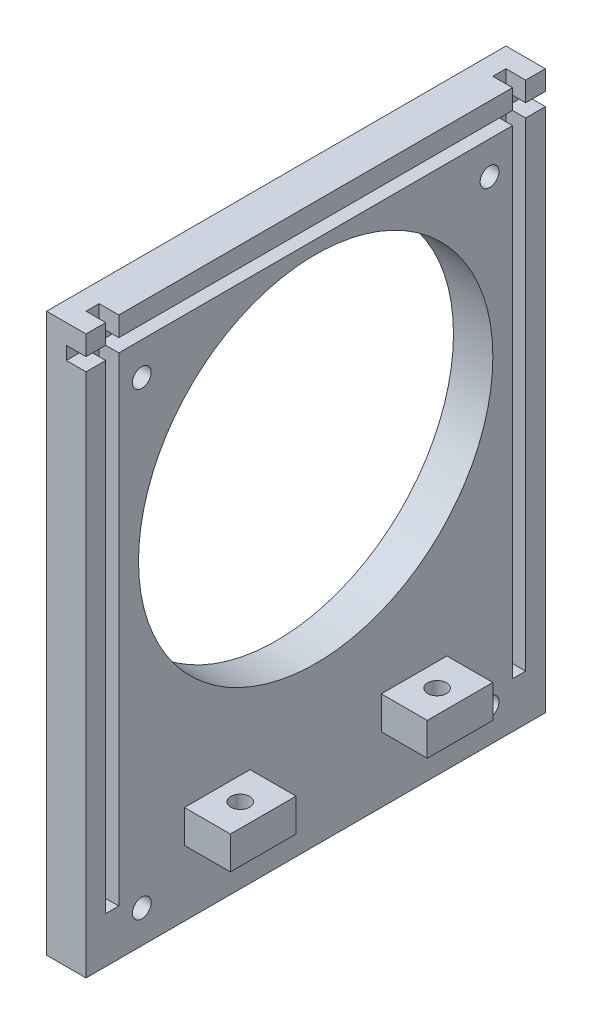
ISO-10303-21;
HEADER;
FILE_DESCRIPTION(('STEP AP214'),'2;1');
FILE_NAME('part.step','',(''),(''),'','','');
FILE_SCHEMA(('AUTOMOTIVE_DESIGN { 1 0 10303 214 1 1 1 1 }'));
ENDSEC;
DATA;
#1=APPLICATION_CONTEXT('core data for automotive mechanical design processes');
#2=APPLICATION_PROTOCOL_DEFINITION('international standard','automotive_design',2000,#1);
#3=PRODUCT_CONTEXT('',#1,'mechanical');
#4=PRODUCT('Part','Part','',(#3));
#5=PRODUCT_RELATED_PRODUCT_CATEGORY('part','',(#4));
#6=PRODUCT_DEFINITION_FORMATION('','',#4);
#7=PRODUCT_DEFINITION_CONTEXT('part definition',#1,'design');
#8=PRODUCT_DEFINITION('design','',#6,#7);
#9=PRODUCT_DEFINITION_SHAPE('','',#8);
#10=(LENGTH_UNIT() NAMED_UNIT(*) SI_UNIT(.MILLI.,.METRE.));
#11=(NAMED_UNIT(*) PLANE_ANGLE_UNIT() SI_UNIT($,.RADIAN.));
#12=(NAMED_UNIT(*) SI_UNIT($,.STERADIAN.) SOLID_ANGLE_UNIT());
#13=UNCERTAINTY_MEASURE_WITH_UNIT(LENGTH_MEASURE(1.E-05),#10,'distance_accuracy_value','');
#14=(GEOMETRIC_REPRESENTATION_CONTEXT(3) GLOBAL_UNCERTAINTY_ASSIGNED_CONTEXT((#13)) GLOBAL_UNIT_ASSIGNED_CONTEXT((#10,
#11,#12)) REPRESENTATION_CONTEXT('',''));
#15=CARTESIAN_POINT('',(0.,0.,0.));
#16=DIRECTION('',(0.,0.,1.));
#17=DIRECTION('',(1.,0.,0.));
#18=AXIS2_PLACEMENT_3D('',#15,#16,#17);
#19=CARTESIAN_POINT('',(2.99999999999999,10.,-35.));
#20=DIRECTION('',(-1.,0.,0.));
#21=DIRECTION('',(0.,0.,1.));
#22=AXIS2_PLACEMENT_3D('',#19,#20,#21);
#23=PLANE('',#22);
#24=DIRECTION('',(0.,0.,-1.));
#25=VECTOR('',#24,1.);
#26=CARTESIAN_POINT('',(3.,15.,-20.));
#27=LINE('',#26,#25);
#28=CARTESIAN_POINT('',(3.,15.,-10.));
#29=VERTEX_POINT('',#28);
#30=CARTESIAN_POINT('',(3.,15.,-20.));
#31=VERTEX_POINT('',#30);
#32=EDGE_CURVE('E274',#29,#31,#27,.T.);
#33=ORIENTED_EDGE('',*,*,#32,.T.);
#34=DIRECTION('',(0.,-1.,0.));
#35=VECTOR('',#34,1.);
#36=CARTESIAN_POINT('',(3.,15.,-20.));
#37=LINE('',#36,#35);
#38=CARTESIAN_POINT('',(3.,10.,-20.));
#39=VERTEX_POINT('',#38);
#40=EDGE_CURVE('E247',#31,#39,#37,.T.);
#41=ORIENTED_EDGE('',*,*,#40,.T.);
#42=DIRECTION('',(0.,0.,1.));
#43=VECTOR('',#42,1.);
#44=CARTESIAN_POINT('',(3.,10.,-20.));
#45=LINE('',#44,#43);
#46=CARTESIAN_POINT('',(3.,10.,-10.));
#47=VERTEX_POINT('',#46);
#48=EDGE_CURVE('E263',#39,#47,#45,.T.);
#49=ORIENTED_EDGE('',*,*,#48,.T.);
#50=DIRECTION('',(0.,1.,0.));
#51=VECTOR('',#50,1.);
#52=CARTESIAN_POINT('',(3.,15.,-10.));
#53=LINE('',#52,#51);
#54=EDGE_CURVE('E47',#47,#29,#53,.T.);
#55=ORIENTED_EDGE('',*,*,#54,.T.);
#56=EDGE_LOOP('',(#33,#41,#49,#55));
#57=FACE_BOUND('',#56,.T.);
#58=DIRECTION('',(0.,-1.,0.));
#59=VECTOR('',#58,1.);
#60=CARTESIAN_POINT('',(2.99999999999999,10.,-35.));
#61=LINE('',#60,#59);
#62=CARTESIAN_POINT('',(2.99999999999999,80.,-35.));
#63=VERTEX_POINT('',#62);
#64=CARTESIAN_POINT('',(2.99999999999999,0.,-35.));
#65=VERTEX_POINT('',#64);
#66=EDGE_CURVE('E40',#63,#65,#61,.T.);
#67=ORIENTED_EDGE('',*,*,#66,.F.);
#68=DIRECTION('',(0.,0.,-1.));
#69=VECTOR('',#68,1.);
#70=CARTESIAN_POINT('',(3.,80.,35.));
#71=LINE('',#70,#69);
#72=CARTESIAN_POINT('',(3.,80.,-32.));
#73=VERTEX_POINT('',#72);
#74=EDGE_CURVE('E343',#73,#63,#71,.T.);
#75=ORIENTED_EDGE('',*,*,#74,.F.);
#76=DIRECTION('',(0.,-1.,0.));
#77=VECTOR('',#76,1.);
#78=CARTESIAN_POINT('',(3.,85.,-32.));
#79=LINE('',#78,#77);
#80=CARTESIAN_POINT('',(3.,6.99999999999999,-32.));
#81=VERTEX_POINT('',#80);
#82=EDGE_CURVE('E396',#73,#81,#79,.T.);
#83=ORIENTED_EDGE('',*,*,#82,.T.);
#84=DIRECTION('',(0.,0.,1.));
#85=VECTOR('',#84,1.);
#86=CARTESIAN_POINT('',(3.,6.99999999999999,-32.));
#87=LINE('',#86,#85);
#88=CARTESIAN_POINT('',(3.,6.99999999999999,-30.));
#89=VERTEX_POINT('',#88);
#90=EDGE_CURVE('E418',#81,#89,#87,.T.);
#91=ORIENTED_EDGE('',*,*,#90,.T.);
#92=DIRECTION('',(0.,1.,0.));
#93=VECTOR('',#92,1.);
#94=CARTESIAN_POINT('',(3.,85.,-30.));
#95=LINE('',#94,#93);
#96=CARTESIAN_POINT('',(3.,80.,-30.));
#97=VERTEX_POINT('',#96);
#98=EDGE_CURVE('E415',#89,#97,#95,.T.);
#99=ORIENTED_EDGE('',*,*,#98,.T.);
#100=CARTESIAN_POINT('',(3.,80.,30.));
#101=VERTEX_POINT('',#100);
#102=EDGE_CURVE('E362',#101,#97,#71,.T.);
#103=ORIENTED_EDGE('',*,*,#102,.F.);
#104=DIRECTION('',(0.,1.,0.));
#105=VECTOR('',#104,1.);
#106=CARTESIAN_POINT('',(3.,85.,30.));
#107=LINE('',#106,#105);
#108=CARTESIAN_POINT('',(3.,6.99999999999999,30.));
#109=VERTEX_POINT('',#108);
#110=EDGE_CURVE('E454',#109,#101,#107,.T.);
#111=ORIENTED_EDGE('',*,*,#110,.F.);
#112=DIRECTION('',(0.,0.,-1.));
#113=VECTOR('',#112,1.);
#114=CARTESIAN_POINT('',(3.,6.99999999999999,32.));
#115=LINE('',#114,#113);
#116=CARTESIAN_POINT('',(3.,6.99999999999999,32.));
#117=VERTEX_POINT('',#116);
#118=EDGE_CURVE('E450',#117,#109,#115,.T.);
#119=ORIENTED_EDGE('',*,*,#118,.F.);
#120=DIRECTION('',(0.,-1.,0.));
#121=VECTOR('',#120,1.);
#122=CARTESIAN_POINT('',(3.,85.,32.));
#123=LINE('',#122,#121);
#124=CARTESIAN_POINT('',(3.,80.,32.));
#125=VERTEX_POINT('',#124);
#126=EDGE_CURVE('E424',#125,#117,#123,.T.);
#127=ORIENTED_EDGE('',*,*,#126,.F.);
#128=CARTESIAN_POINT('',(3.,80.,35.));
#129=VERTEX_POINT('',#128);
#130=EDGE_CURVE('E359',#129,#125,#71,.T.);
#131=ORIENTED_EDGE('',*,*,#130,.F.);
#132=DIRECTION('',(0.,-1.,0.));
#133=VECTOR('',#132,1.);
#134=CARTESIAN_POINT('',(3.,10.,35.));
#135=LINE('',#134,#133);
#136=CARTESIAN_POINT('',(3.,0.,35.));
#137=VERTEX_POINT('',#136);
#138=EDGE_CURVE('E490',#129,#137,#135,.T.);
#139=ORIENTED_EDGE('',*,*,#138,.T.);
#140=DIRECTION('',(0.,0.,-1.));
#141=VECTOR('',#140,1.);
#142=CARTESIAN_POINT('',(2.99999999999999,0.,-35.));
#143=LINE('',#142,#141);
#144=EDGE_CURVE('E480',#137,#65,#143,.T.);
#145=ORIENTED_EDGE('',*,*,#144,.T.);
#146=EDGE_LOOP('',(#67,#75,#83,#91,#99,#103,#111,#119,#127,#131,#139,#145));
#147=FACE_BOUND('',#146,.T.);
#148=CARTESIAN_POINT('',(3.,51.,0.));
#149=DIRECTION('',(1.,0.,0.));
#150=DIRECTION('',(0.,0.,-1.));
#151=AXIS2_PLACEMENT_3D('',#148,#149,#150);
#152=CIRCLE('',#151,27.);
#153=CARTESIAN_POINT('',(3.,51.,-27.));
#154=VERTEX_POINT('',#153);
#155=EDGE_CURVE('E337',#154,#154,#152,.T.);
#156=ORIENTED_EDGE('',*,*,#155,.F.);
#157=EDGE_LOOP('',(#156));
#158=FACE_BOUND('',#157,.T.);
#159=CARTESIAN_POINT('',(3.,75.,26.5));
#160=DIRECTION('',(-1.,0.,0.));
#161=DIRECTION('',(0.,0.,1.));
#162=AXIS2_PLACEMENT_3D('',#159,#160,#161);
#163=CIRCLE('',#162,1.435);
#164=CARTESIAN_POINT('',(3.,75.,27.935));
#165=VERTEX_POINT('',#164);
#166=EDGE_CURVE('E334',#165,#165,#163,.T.);
#167=ORIENTED_EDGE('',*,*,#166,.T.);
#168=EDGE_LOOP('',(#167));
#169=FACE_BOUND('',#168,.T.);
#170=CARTESIAN_POINT('',(3.,75.,-26.5));
#171=DIRECTION('',(-1.,0.,0.));
#172=DIRECTION('',(0.,0.,1.));
#173=AXIS2_PLACEMENT_3D('',#170,#171,#172);
#174=CIRCLE('',#173,1.435);
#175=CARTESIAN_POINT('',(3.,75.,-25.065));
#176=VERTEX_POINT('',#175);
#177=EDGE_CURVE('E328',#176,#176,#174,.T.);
#178=ORIENTED_EDGE('',*,*,#177,.T.);
#179=EDGE_LOOP('',(#178));
#180=FACE_BOUND('',#179,.T.);
#181=CARTESIAN_POINT('',(3.,4.99999999999999,-26.5));
#182=DIRECTION('',(-1.,0.,0.));
#183=DIRECTION('',(0.,0.,1.));
#184=AXIS2_PLACEMENT_3D('',#181,#182,#183);
#185=CIRCLE('',#184,1.435);
#186=CARTESIAN_POINT('',(3.,4.99999999999999,-25.065));
#187=VERTEX_POINT('',#186);
#188=EDGE_CURVE('E317',#187,#187,#185,.T.);
#189=ORIENTED_EDGE('',*,*,#188,.T.);
#190=EDGE_LOOP('',(#189));
#191=FACE_BOUND('',#190,.T.);
#192=CARTESIAN_POINT('',(3.,4.99999999999999,26.5));
#193=DIRECTION('',(-1.,0.,0.));
#194=DIRECTION('',(0.,0.,1.));
#195=AXIS2_PLACEMENT_3D('',#192,#193,#194);
#196=CIRCLE('',#195,1.435);
#197=CARTESIAN_POINT('',(3.,4.99999999999999,27.935));
#198=VERTEX_POINT('',#197);
#199=EDGE_CURVE('E322',#198,#198,#196,.T.);
#200=ORIENTED_EDGE('',*,*,#199,.T.);
#201=EDGE_LOOP('',(#200));
#202=FACE_BOUND('',#201,.T.);
#203=DIRECTION('',(0.,-1.,0.));
#204=VECTOR('',#203,1.);
#205=CARTESIAN_POINT('',(3.,15.,20.));
#206=LINE('',#205,#204);
#207=CARTESIAN_POINT('',(3.,15.,20.));
#208=VERTEX_POINT('',#207);
#209=CARTESIAN_POINT('',(3.,10.,20.));
#210=VERTEX_POINT('',#209);
#211=EDGE_CURVE('E252',#208,#210,#206,.T.);
#212=ORIENTED_EDGE('',*,*,#211,.F.);
#213=DIRECTION('',(0.,0.,1.));
#214=VECTOR('',#213,1.);
#215=CARTESIAN_POINT('',(3.,15.,20.));
#216=LINE('',#215,#214);
#217=CARTESIAN_POINT('',(3.,15.,10.));
#218=VERTEX_POINT('',#217);
#219=EDGE_CURVE('E288',#218,#208,#216,.T.);
#220=ORIENTED_EDGE('',*,*,#219,.F.);
#221=DIRECTION('',(0.,1.,0.));
#222=VECTOR('',#221,1.);
#223=CARTESIAN_POINT('',(3.,15.,10.));
#224=LINE('',#223,#222);
#225=CARTESIAN_POINT('',(3.,10.,10.));
#226=VERTEX_POINT('',#225);
#227=EDGE_CURVE('E298',#226,#218,#224,.T.);
#228=ORIENTED_EDGE('',*,*,#227,.F.);
#229=DIRECTION('',(0.,0.,-1.));
#230=VECTOR('',#229,1.);
#231=CARTESIAN_POINT('',(3.,10.,20.));
#232=LINE('',#231,#230);
#233=EDGE_CURVE('E55',#210,#226,#232,.T.);
#234=ORIENTED_EDGE('',*,*,#233,.F.);
#235=EDGE_LOOP('',(#212,#220,#228,#234));
#236=FACE_BOUND('',#235,.T.);
#237=ADVANCED_FACE('F33',(#57,#147,#158,#169,#180,#191,#202,#236),#23,.F.);
#238=CARTESIAN_POINT('',(3.,85.,-32.));
#239=VERTEX_POINT('',#238);
#240=CARTESIAN_POINT('',(3.,82.,-32.));
#241=VERTEX_POINT('',#240);
#242=EDGE_CURVE('E411',#239,#241,#79,.T.);
#243=ORIENTED_EDGE('',*,*,#242,.T.);
#244=DIRECTION('',(0.,0.,1.));
#245=VECTOR('',#244,1.);
#246=CARTESIAN_POINT('',(3.,82.,35.));
#247=LINE('',#246,#245);
#248=CARTESIAN_POINT('',(2.99999999999999,82.,-35.));
#249=VERTEX_POINT('',#248);
#250=EDGE_CURVE('E348',#249,#241,#247,.T.);
#251=ORIENTED_EDGE('',*,*,#250,.F.);
#252=CARTESIAN_POINT('',(2.99999999999999,85.,-35.));
#253=VERTEX_POINT('',#252);
#254=EDGE_CURVE('E11',#253,#249,#61,.T.);
#255=ORIENTED_EDGE('',*,*,#254,.F.);
#256=DIRECTION('',(0.,0.,-1.));
#257=VECTOR('',#256,1.);
#258=CARTESIAN_POINT('',(2.99999999999999,85.,-35.));
#259=LINE('',#258,#257);
#260=EDGE_CURVE('E472',#239,#253,#259,.T.);
#261=ORIENTED_EDGE('',*,*,#260,.F.);
#262=EDGE_LOOP('',(#243,#251,#255,#261));
#263=FACE_BOUND('',#262,.T.);
#264=ADVANCED_FACE('F532',(#263),#23,.F.);
#265=CARTESIAN_POINT('',(3.,82.,30.));
#266=VERTEX_POINT('',#265);
#267=CARTESIAN_POINT('',(3.,85.,30.));
#268=VERTEX_POINT('',#267);
#269=EDGE_CURVE('E453',#266,#268,#107,.T.);
#270=ORIENTED_EDGE('',*,*,#269,.F.);
#271=CARTESIAN_POINT('',(3.,82.,-30.));
#272=VERTEX_POINT('',#271);
#273=EDGE_CURVE('E364',#272,#266,#247,.T.);
#274=ORIENTED_EDGE('',*,*,#273,.F.);
#275=CARTESIAN_POINT('',(3.,85.,-30.));
#276=VERTEX_POINT('',#275);
#277=EDGE_CURVE('E414',#272,#276,#95,.T.);
#278=ORIENTED_EDGE('',*,*,#277,.T.);
#279=EDGE_CURVE('E477',#268,#276,#259,.T.);
#280=ORIENTED_EDGE('',*,*,#279,.F.);
#281=EDGE_LOOP('',(#270,#274,#278,#280));
#282=FACE_BOUND('',#281,.T.);
#283=ADVANCED_FACE('F600',(#282),#23,.F.);
#284=CARTESIAN_POINT('',(3.,85.,35.));
#285=VERTEX_POINT('',#284);
#286=CARTESIAN_POINT('',(3.,82.,35.));
#287=VERTEX_POINT('',#286);
#288=EDGE_CURVE('E491',#285,#287,#135,.T.);
#289=ORIENTED_EDGE('',*,*,#288,.T.);
#290=CARTESIAN_POINT('',(3.,82.,32.));
#291=VERTEX_POINT('',#290);
#292=EDGE_CURVE('E361',#291,#287,#247,.T.);
#293=ORIENTED_EDGE('',*,*,#292,.F.);
#294=CARTESIAN_POINT('',(3.,85.,32.));
#295=VERTEX_POINT('',#294);
#296=EDGE_CURVE('E447',#295,#291,#123,.T.);
#297=ORIENTED_EDGE('',*,*,#296,.F.);
#298=EDGE_CURVE('E473',#285,#295,#259,.T.);
#299=ORIENTED_EDGE('',*,*,#298,.F.);
#300=EDGE_LOOP('',(#289,#293,#297,#299));
#301=FACE_BOUND('',#300,.T.);
#302=ADVANCED_FACE('F618',(#301),#23,.F.);
#303=CARTESIAN_POINT('',(0.,85.,32.));
#304=DIRECTION('',(0.,0.,1.));
#305=DIRECTION('',(0.,-1.,0.));
#306=AXIS2_PLACEMENT_3D('',#303,#304,#305);
#307=PLANE('',#306);
#308=ORIENTED_EDGE('',*,*,#296,.T.);
#309=DIRECTION('',(-1.,0.,0.));
#310=VECTOR('',#309,1.);
#311=CARTESIAN_POINT('',(0.,82.,32.));
#312=LINE('',#311,#310);
#313=CARTESIAN_POINT('',(0.,82.,32.));
#314=VERTEX_POINT('',#313);
#315=EDGE_CURVE('E393',#291,#314,#312,.T.);
#316=ORIENTED_EDGE('',*,*,#315,.T.);
#317=DIRECTION('',(0.,-1.,0.));
#318=VECTOR('',#317,1.);
#319=CARTESIAN_POINT('',(0.,85.,32.));
#320=LINE('',#319,#318);
#321=CARTESIAN_POINT('',(0.,85.,32.));
#322=VERTEX_POINT('',#321);
#323=EDGE_CURVE('E432',#322,#314,#320,.T.);
#324=ORIENTED_EDGE('',*,*,#323,.F.);
#325=DIRECTION('',(1.,0.,0.));
#326=VECTOR('',#325,1.);
#327=CARTESIAN_POINT('',(0.,85.,32.));
#328=LINE('',#327,#326);
#329=EDGE_CURVE('E457',#322,#295,#328,.T.);
#330=ORIENTED_EDGE('',*,*,#329,.T.);
#331=EDGE_LOOP('',(#308,#316,#324,#330));
#332=FACE_BOUND('',#331,.T.);
#333=ADVANCED_FACE('F623',(#332),#307,.F.);
#334=CARTESIAN_POINT('',(0.,85.,30.));
#335=DIRECTION('',(0.,0.,-1.));
#336=DIRECTION('',(0.,1.,0.));
#337=AXIS2_PLACEMENT_3D('',#334,#335,#336);
#338=PLANE('',#337);
#339=DIRECTION('',(0.,1.,0.));
#340=VECTOR('',#339,1.);
#341=CARTESIAN_POINT('',(0.,85.,30.));
#342=LINE('',#341,#340);
#343=CARTESIAN_POINT('',(0.,82.,30.));
#344=VERTEX_POINT('',#343);
#345=CARTESIAN_POINT('',(0.,85.,30.));
#346=VERTEX_POINT('',#345);
#347=EDGE_CURVE('E439',#344,#346,#342,.T.);
#348=ORIENTED_EDGE('',*,*,#347,.F.);
#349=DIRECTION('',(1.,0.,0.));
#350=VECTOR('',#349,1.);
#351=CARTESIAN_POINT('',(0.,82.,30.));
#352=LINE('',#351,#350);
#353=EDGE_CURVE('E390',#344,#266,#352,.T.);
#354=ORIENTED_EDGE('',*,*,#353,.T.);
#355=ORIENTED_EDGE('',*,*,#269,.T.);
#356=DIRECTION('',(1.,0.,0.));
#357=VECTOR('',#356,1.);
#358=CARTESIAN_POINT('',(0.,85.,30.));
#359=LINE('',#358,#357);
#360=EDGE_CURVE('E460',#346,#268,#359,.T.);
#361=ORIENTED_EDGE('',*,*,#360,.F.);
#362=EDGE_LOOP('',(#348,#354,#355,#361));
#363=FACE_BOUND('',#362,.T.);
#364=ADVANCED_FACE('F597',(#363),#338,.F.);
#365=CARTESIAN_POINT('',(0.,85.,-32.));
#366=DIRECTION('',(0.,0.,1.));
#367=DIRECTION('',(0.,-1.,0.));
#368=AXIS2_PLACEMENT_3D('',#365,#366,#367);
#369=PLANE('',#368);
#370=DIRECTION('',(-1.,0.,0.));
#371=VECTOR('',#370,1.);
#372=CARTESIAN_POINT('',(0.,82.,-32.));
#373=LINE('',#372,#371);
#374=CARTESIAN_POINT('',(0.,82.,-32.));
#375=VERTEX_POINT('',#374);
#376=EDGE_CURVE('E387',#241,#375,#373,.T.);
#377=ORIENTED_EDGE('',*,*,#376,.F.);
#378=ORIENTED_EDGE('',*,*,#242,.F.);
#379=DIRECTION('',(1.,0.,0.));
#380=VECTOR('',#379,1.);
#381=CARTESIAN_POINT('',(0.,85.,-32.));
#382=LINE('',#381,#380);
#383=CARTESIAN_POINT('',(0.,85.,-32.));
#384=VERTEX_POINT('',#383);
#385=EDGE_CURVE('E410',#384,#239,#382,.T.);
#386=ORIENTED_EDGE('',*,*,#385,.F.);
#387=DIRECTION('',(0.,-1.,0.));
#388=VECTOR('',#387,1.);
#389=CARTESIAN_POINT('',(0.,85.,-32.));
#390=LINE('',#389,#388);
#391=EDGE_CURVE('E397',#384,#375,#390,.T.);
#392=ORIENTED_EDGE('',*,*,#391,.T.);
#393=EDGE_LOOP('',(#377,#378,#386,#392));
#394=FACE_BOUND('',#393,.T.);
#395=ADVANCED_FACE('F538',(#394),#369,.T.);
#396=CARTESIAN_POINT('',(0.,85.,-30.));
#397=DIRECTION('',(0.,0.,-1.));
#398=DIRECTION('',(0.,1.,0.));
#399=AXIS2_PLACEMENT_3D('',#396,#397,#398);
#400=PLANE('',#399);
#401=DIRECTION('',(1.,0.,0.));
#402=VECTOR('',#401,1.);
#403=CARTESIAN_POINT('',(0.,82.,-30.));
#404=LINE('',#403,#402);
#405=CARTESIAN_POINT('',(0.,82.,-30.));
#406=VERTEX_POINT('',#405);
#407=EDGE_CURVE('E385',#406,#272,#404,.T.);
#408=ORIENTED_EDGE('',*,*,#407,.F.);
#409=DIRECTION('',(0.,1.,0.));
#410=VECTOR('',#409,1.);
#411=CARTESIAN_POINT('',(0.,85.,-30.));
#412=LINE('',#411,#410);
#413=CARTESIAN_POINT('',(0.,85.,-30.));
#414=VERTEX_POINT('',#413);
#415=EDGE_CURVE('E404',#406,#414,#412,.T.);
#416=ORIENTED_EDGE('',*,*,#415,.T.);
#417=DIRECTION('',(1.,0.,0.));
#418=VECTOR('',#417,1.);
#419=CARTESIAN_POINT('',(0.,85.,-30.));
#420=LINE('',#419,#418);
#421=EDGE_CURVE('E427',#414,#276,#420,.T.);
#422=ORIENTED_EDGE('',*,*,#421,.T.);
#423=ORIENTED_EDGE('',*,*,#277,.F.);
#424=EDGE_LOOP('',(#408,#416,#422,#423));
#425=FACE_BOUND('',#424,.T.);
#426=ADVANCED_FACE('F605',(#425),#400,.T.);
#427=CARTESIAN_POINT('',(0.,85.,0.));
#428=DIRECTION('',(0.,1.,0.));
#429=DIRECTION('',(0.,0.,1.));
#430=AXIS2_PLACEMENT_3D('',#427,#428,#429);
#431=PLANE('',#430);
#432=DIRECTION('',(0.,0.,-1.));
#433=VECTOR('',#432,1.);
#434=CARTESIAN_POINT('',(0.,85.,-32.));
#435=LINE('',#434,#433);
#436=EDGE_CURVE('E400',#414,#384,#435,.T.);
#437=ORIENTED_EDGE('',*,*,#436,.T.);
#438=ORIENTED_EDGE('',*,*,#385,.T.);
#439=ORIENTED_EDGE('',*,*,#260,.T.);
#440=DIRECTION('',(-1.,0.,0.));
#441=VECTOR('',#440,1.);
#442=CARTESIAN_POINT('',(-3.00000000000001,85.,-35.));
#443=LINE('',#442,#441);
#444=CARTESIAN_POINT('',(-3.00000000000001,85.,-35.));
#445=VERTEX_POINT('',#444);
#446=EDGE_CURVE('E476',#253,#445,#443,.T.);
#447=ORIENTED_EDGE('',*,*,#446,.T.);
#448=DIRECTION('',(0.,0.,1.));
#449=VECTOR('',#448,1.);
#450=CARTESIAN_POINT('',(-3.00000000000001,85.,-35.));
#451=LINE('',#450,#449);
#452=CARTESIAN_POINT('',(-3.,85.,35.));
#453=VERTEX_POINT('',#452);
#454=EDGE_CURVE('E459',#445,#453,#451,.T.);
#455=ORIENTED_EDGE('',*,*,#454,.T.);
#456=DIRECTION('',(1.,0.,0.));
#457=VECTOR('',#456,1.);
#458=CARTESIAN_POINT('',(-3.,85.,35.));
#459=LINE('',#458,#457);
#460=EDGE_CURVE('E469',#453,#285,#459,.T.);
#461=ORIENTED_EDGE('',*,*,#460,.T.);
#462=ORIENTED_EDGE('',*,*,#298,.T.);
#463=ORIENTED_EDGE('',*,*,#329,.F.);
#464=DIRECTION('',(0.,0.,1.));
#465=VECTOR('',#464,1.);
#466=CARTESIAN_POINT('',(0.,85.,32.));
#467=LINE('',#466,#465);
#468=EDGE_CURVE('E443',#346,#322,#467,.T.);
#469=ORIENTED_EDGE('',*,*,#468,.F.);
#470=ORIENTED_EDGE('',*,*,#360,.T.);
#471=ORIENTED_EDGE('',*,*,#279,.T.);
#472=ORIENTED_EDGE('',*,*,#421,.F.);
#473=EDGE_LOOP('',(#437,#438,#439,#447,#455,#461,#462,#463,#469,#470,#471,#472));
#474=FACE_BOUND('',#473,.T.);
#475=ADVANCED_FACE('F524',(#474),#431,.T.);
#476=CARTESIAN_POINT('',(-3.00000000000001,10.,-35.));
#477=DIRECTION('',(0.,0.,1.));
#478=DIRECTION('',(1.,0.,0.));
#479=AXIS2_PLACEMENT_3D('',#476,#477,#478);
#480=PLANE('',#479);
#481=ORIENTED_EDGE('',*,*,#254,.T.);
#482=DIRECTION('',(1.,0.,0.));
#483=VECTOR('',#482,1.);
#484=CARTESIAN_POINT('',(0.,82.,-35.));
#485=LINE('',#484,#483);
#486=CARTESIAN_POINT('',(0.,82.,-35.));
#487=VERTEX_POINT('',#486);
#488=EDGE_CURVE('E369',#487,#249,#485,.T.);
#489=ORIENTED_EDGE('',*,*,#488,.F.);
#490=DIRECTION('',(0.,1.,0.));
#491=VECTOR('',#490,1.);
#492=CARTESIAN_POINT('',(0.,82.,-35.));
#493=LINE('',#492,#491);
#494=CARTESIAN_POINT('',(0.,80.,-35.));
#495=VERTEX_POINT('',#494);
#496=EDGE_CURVE('E351',#495,#487,#493,.T.);
#497=ORIENTED_EDGE('',*,*,#496,.F.);
#498=DIRECTION('',(1.,0.,0.));
#499=VECTOR('',#498,1.);
#500=CARTESIAN_POINT('',(0.,80.,-35.));
#501=LINE('',#500,#499);
#502=EDGE_CURVE('E371',#495,#63,#501,.T.);
#503=ORIENTED_EDGE('',*,*,#502,.T.);
#504=ORIENTED_EDGE('',*,*,#66,.T.);
#505=DIRECTION('',(-1.,0.,0.));
#506=VECTOR('',#505,1.);
#507=CARTESIAN_POINT('',(-3.00000000000001,0.,-35.));
#508=LINE('',#507,#506);
#509=CARTESIAN_POINT('',(-3.00000000000001,0.,-35.));
#510=VERTEX_POINT('',#509);
#511=EDGE_CURVE('E483',#65,#510,#508,.T.);
#512=ORIENTED_EDGE('',*,*,#511,.T.);
#513=DIRECTION('',(0.,-1.,0.));
#514=VECTOR('',#513,1.);
#515=CARTESIAN_POINT('',(-3.00000000000001,10.,-35.));
#516=LINE('',#515,#514);
#517=EDGE_CURVE('E496',#445,#510,#516,.T.);
#518=ORIENTED_EDGE('',*,*,#517,.F.);
#519=ORIENTED_EDGE('',*,*,#446,.F.);
#520=EDGE_LOOP('',(#481,#489,#497,#503,#504,#512,#518,#519));
#521=FACE_BOUND('',#520,.T.);
#522=ADVANCED_FACE('F504',(#521),#480,.F.);
#523=CARTESIAN_POINT('',(-3.00000000000001,10.,-35.));
#524=DIRECTION('',(1.,0.,0.));
#525=DIRECTION('',(0.,0.,-1.));
#526=AXIS2_PLACEMENT_3D('',#523,#524,#525);
#527=PLANE('',#526);
#528=CARTESIAN_POINT('',(-3.,4.99999999999999,26.5));
#529=DIRECTION('',(-1.,0.,0.));
#530=DIRECTION('',(0.,0.,1.));
#531=AXIS2_PLACEMENT_3D('',#528,#529,#530);
#532=CIRCLE('',#531,1.435);
#533=CARTESIAN_POINT('',(-3.,4.99999999999999,27.935));
#534=VERTEX_POINT('',#533);
#535=EDGE_CURVE('E314',#534,#534,#532,.T.);
#536=ORIENTED_EDGE('',*,*,#535,.F.);
#537=EDGE_LOOP('',(#536));
#538=FACE_BOUND('',#537,.T.);
#539=CARTESIAN_POINT('',(-3.00000000000001,4.99999999999999,-26.5));
#540=DIRECTION('',(-1.,0.,0.));
#541=DIRECTION('',(0.,0.,1.));
#542=AXIS2_PLACEMENT_3D('',#539,#540,#541);
#543=CIRCLE('',#542,1.435);
#544=CARTESIAN_POINT('',(-3.00000000000001,4.99999999999999,-25.065));
#545=VERTEX_POINT('',#544);
#546=EDGE_CURVE('E313',#545,#545,#543,.T.);
#547=ORIENTED_EDGE('',*,*,#546,.F.);
#548=EDGE_LOOP('',(#547));
#549=FACE_BOUND('',#548,.T.);
#550=CARTESIAN_POINT('',(-3.00000000000001,75.,-26.5));
#551=DIRECTION('',(-1.,0.,0.));
#552=DIRECTION('',(0.,0.,1.));
#553=AXIS2_PLACEMENT_3D('',#550,#551,#552);
#554=CIRCLE('',#553,1.435);
#555=CARTESIAN_POINT('',(-3.00000000000001,75.,-25.065));
#556=VERTEX_POINT('',#555);
#557=EDGE_CURVE('E325',#556,#556,#554,.T.);
#558=ORIENTED_EDGE('',*,*,#557,.F.);
#559=EDGE_LOOP('',(#558));
#560=FACE_BOUND('',#559,.T.);
#561=CARTESIAN_POINT('',(-3.,75.,26.5));
#562=DIRECTION('',(-1.,0.,0.));
#563=DIRECTION('',(0.,0.,1.));
#564=AXIS2_PLACEMENT_3D('',#561,#562,#563);
#565=CIRCLE('',#564,1.435);
#566=CARTESIAN_POINT('',(-3.,75.,27.935));
#567=VERTEX_POINT('',#566);
#568=EDGE_CURVE('E331',#567,#567,#565,.T.);
#569=ORIENTED_EDGE('',*,*,#568,.F.);
#570=EDGE_LOOP('',(#569));
#571=FACE_BOUND('',#570,.T.);
#572=CARTESIAN_POINT('',(-3.,51.,0.));
#573=DIRECTION('',(1.,0.,0.));
#574=DIRECTION('',(0.,0.,-1.));
#575=AXIS2_PLACEMENT_3D('',#572,#573,#574);
#576=CIRCLE('',#575,27.);
#577=CARTESIAN_POINT('',(-3.,51.,-27.));
#578=VERTEX_POINT('',#577);
#579=EDGE_CURVE('E340',#578,#578,#576,.F.);
#580=ORIENTED_EDGE('',*,*,#579,.F.);
#581=EDGE_LOOP('',(#580));
#582=FACE_BOUND('',#581,.T.);
#583=DIRECTION('',(0.,0.,1.));
#584=VECTOR('',#583,1.);
#585=CARTESIAN_POINT('',(-3.00000000000001,0.,-35.));
#586=LINE('',#585,#584);
#587=CARTESIAN_POINT('',(-3.,0.,35.));
#588=VERTEX_POINT('',#587);
#589=EDGE_CURVE('E485',#510,#588,#586,.T.);
#590=ORIENTED_EDGE('',*,*,#589,.T.);
#591=DIRECTION('',(0.,-1.,0.));
#592=VECTOR('',#591,1.);
#593=CARTESIAN_POINT('',(-3.,10.,35.));
#594=LINE('',#593,#592);
#595=EDGE_CURVE('E494',#453,#588,#594,.T.);
#596=ORIENTED_EDGE('',*,*,#595,.F.);
#597=ORIENTED_EDGE('',*,*,#454,.F.);
#598=ORIENTED_EDGE('',*,*,#517,.T.);
#599=EDGE_LOOP('',(#590,#596,#597,#598));
#600=FACE_BOUND('',#599,.T.);
#601=ADVANCED_FACE('F522',(#538,#549,#560,#571,#582,#600),#527,.F.);
#602=CARTESIAN_POINT('',(-3.,10.,35.));
#603=DIRECTION('',(0.,0.,-1.));
#604=DIRECTION('',(-1.,0.,0.));
#605=AXIS2_PLACEMENT_3D('',#602,#603,#604);
#606=PLANE('',#605);
#607=DIRECTION('',(0.,-1.,0.));
#608=VECTOR('',#607,1.);
#609=CARTESIAN_POINT('',(0.,82.,35.));
#610=LINE('',#609,#608);
#611=CARTESIAN_POINT('',(0.,82.,35.));
#612=VERTEX_POINT('',#611);
#613=CARTESIAN_POINT('',(0.,80.,35.));
#614=VERTEX_POINT('',#613);
#615=EDGE_CURVE('E344',#612,#614,#610,.T.);
#616=ORIENTED_EDGE('',*,*,#615,.F.);
#617=DIRECTION('',(1.,0.,0.));
#618=VECTOR('',#617,1.);
#619=CARTESIAN_POINT('',(0.,82.,35.));
#620=LINE('',#619,#618);
#621=EDGE_CURVE('E365',#612,#287,#620,.T.);
#622=ORIENTED_EDGE('',*,*,#621,.T.);
#623=ORIENTED_EDGE('',*,*,#288,.F.);
#624=ORIENTED_EDGE('',*,*,#460,.F.);
#625=ORIENTED_EDGE('',*,*,#595,.T.);
#626=DIRECTION('',(1.,0.,0.));
#627=VECTOR('',#626,1.);
#628=CARTESIAN_POINT('',(-3.,0.,35.));
#629=LINE('',#628,#627);
#630=EDGE_CURVE('E487',#588,#137,#629,.T.);
#631=ORIENTED_EDGE('',*,*,#630,.T.);
#632=ORIENTED_EDGE('',*,*,#138,.F.);
#633=DIRECTION('',(1.,0.,0.));
#634=VECTOR('',#633,1.);
#635=CARTESIAN_POINT('',(0.,80.,35.));
#636=LINE('',#635,#634);
#637=EDGE_CURVE('E357',#614,#129,#636,.T.);
#638=ORIENTED_EDGE('',*,*,#637,.F.);
#639=EDGE_LOOP('',(#616,#622,#623,#624,#625,#631,#632,#638));
#640=FACE_BOUND('',#639,.T.);
#641=ADVANCED_FACE('F520',(#640),#606,.F.);
#642=CARTESIAN_POINT('',(0.,0.,0.));
#643=DIRECTION('',(0.,1.,0.));
#644=DIRECTION('',(0.,0.,1.));
#645=AXIS2_PLACEMENT_3D('',#642,#643,#644);
#646=PLANE('',#645);
#647=ORIENTED_EDGE('',*,*,#144,.F.);
#648=ORIENTED_EDGE('',*,*,#630,.F.);
#649=ORIENTED_EDGE('',*,*,#589,.F.);
#650=ORIENTED_EDGE('',*,*,#511,.F.);
#651=EDGE_LOOP('',(#647,#648,#649,#650));
#652=FACE_BOUND('',#651,.T.);
#653=ADVANCED_FACE('F511',(#652),#646,.F.);
#654=CARTESIAN_POINT('',(0.,80.,32.));
#655=VERTEX_POINT('',#654);
#656=CARTESIAN_POINT('',(0.,6.99999999999999,32.));
#657=VERTEX_POINT('',#656);
#658=EDGE_CURVE('E436',#655,#657,#320,.T.);
#659=ORIENTED_EDGE('',*,*,#658,.F.);
#660=DIRECTION('',(1.,0.,0.));
#661=VECTOR('',#660,1.);
#662=CARTESIAN_POINT('',(0.,80.,32.));
#663=LINE('',#662,#661);
#664=EDGE_CURVE('E382',#655,#125,#663,.T.);
#665=ORIENTED_EDGE('',*,*,#664,.T.);
#666=ORIENTED_EDGE('',*,*,#126,.T.);
#667=DIRECTION('',(1.,0.,0.));
#668=VECTOR('',#667,1.);
#669=CARTESIAN_POINT('',(0.,6.99999999999999,32.));
#670=LINE('',#669,#668);
#671=EDGE_CURVE('E446',#657,#117,#670,.T.);
#672=ORIENTED_EDGE('',*,*,#671,.F.);
#673=EDGE_LOOP('',(#659,#665,#666,#672));
#674=FACE_BOUND('',#673,.T.);
#675=ADVANCED_FACE('F577',(#674),#307,.F.);
#676=ORIENTED_EDGE('',*,*,#110,.T.);
#677=DIRECTION('',(-1.,0.,0.));
#678=VECTOR('',#677,1.);
#679=CARTESIAN_POINT('',(0.,80.,30.));
#680=LINE('',#679,#678);
#681=CARTESIAN_POINT('',(0.,80.,30.));
#682=VERTEX_POINT('',#681);
#683=EDGE_CURVE('E379',#101,#682,#680,.T.);
#684=ORIENTED_EDGE('',*,*,#683,.T.);
#685=CARTESIAN_POINT('',(0.,6.99999999999999,30.));
#686=VERTEX_POINT('',#685);
#687=EDGE_CURVE('E440',#686,#682,#342,.T.);
#688=ORIENTED_EDGE('',*,*,#687,.F.);
#689=DIRECTION('',(1.,0.,0.));
#690=VECTOR('',#689,1.);
#691=CARTESIAN_POINT('',(0.,6.99999999999999,30.));
#692=LINE('',#691,#690);
#693=EDGE_CURVE('E463',#686,#109,#692,.T.);
#694=ORIENTED_EDGE('',*,*,#693,.T.);
#695=EDGE_LOOP('',(#676,#684,#688,#694));
#696=FACE_BOUND('',#695,.T.);
#697=ADVANCED_FACE('F569',(#696),#338,.F.);
#698=CARTESIAN_POINT('',(0.,6.99999999999999,32.));
#699=DIRECTION('',(0.,-1.,0.));
#700=DIRECTION('',(0.,0.,-1.));
#701=AXIS2_PLACEMENT_3D('',#698,#699,#700);
#702=PLANE('',#701);
#703=ORIENTED_EDGE('',*,*,#118,.T.);
#704=ORIENTED_EDGE('',*,*,#693,.F.);
#705=DIRECTION('',(0.,0.,-1.));
#706=VECTOR('',#705,1.);
#707=CARTESIAN_POINT('',(0.,6.99999999999999,32.));
#708=LINE('',#707,#706);
#709=EDGE_CURVE('E435',#657,#686,#708,.T.);
#710=ORIENTED_EDGE('',*,*,#709,.F.);
#711=ORIENTED_EDGE('',*,*,#671,.T.);
#712=EDGE_LOOP('',(#703,#704,#710,#711));
#713=FACE_BOUND('',#712,.T.);
#714=ADVANCED_FACE('F572',(#713),#702,.F.);
#715=CARTESIAN_POINT('',(0.,0.,0.));
#716=DIRECTION('',(1.,0.,0.));
#717=DIRECTION('',(0.,0.,-1.));
#718=AXIS2_PLACEMENT_3D('',#715,#716,#717);
#719=PLANE('',#718);
#720=ORIENTED_EDGE('',*,*,#687,.T.);
#721=DIRECTION('',(0.,0.,-1.));
#722=VECTOR('',#721,1.);
#723=CARTESIAN_POINT('',(0.,80.,35.));
#724=LINE('',#723,#722);
#725=CARTESIAN_POINT('',(0.,80.,-30.));
#726=VERTEX_POINT('',#725);
#727=EDGE_CURVE('E352',#682,#726,#724,.T.);
#728=ORIENTED_EDGE('',*,*,#727,.T.);
#729=CARTESIAN_POINT('',(0.,6.99999999999999,-30.));
#730=VERTEX_POINT('',#729);
#731=EDGE_CURVE('E405',#730,#726,#412,.T.);
#732=ORIENTED_EDGE('',*,*,#731,.F.);
#733=DIRECTION('',(0.,0.,1.));
#734=VECTOR('',#733,1.);
#735=CARTESIAN_POINT('',(0.,6.99999999999999,-32.));
#736=LINE('',#735,#734);
#737=CARTESIAN_POINT('',(0.,6.99999999999999,-32.));
#738=VERTEX_POINT('',#737);
#739=EDGE_CURVE('E408',#738,#730,#736,.T.);
#740=ORIENTED_EDGE('',*,*,#739,.F.);
#741=CARTESIAN_POINT('',(0.,80.,-32.));
#742=VERTEX_POINT('',#741);
#743=EDGE_CURVE('E401',#742,#738,#390,.T.);
#744=ORIENTED_EDGE('',*,*,#743,.F.);
#745=EDGE_CURVE('E347',#742,#495,#724,.T.);
#746=ORIENTED_EDGE('',*,*,#745,.T.);
#747=ORIENTED_EDGE('',*,*,#496,.T.);
#748=DIRECTION('',(0.,0.,1.));
#749=VECTOR('',#748,1.);
#750=CARTESIAN_POINT('',(0.,82.,35.));
#751=LINE('',#750,#749);
#752=EDGE_CURVE('E355',#487,#375,#751,.T.);
#753=ORIENTED_EDGE('',*,*,#752,.T.);
#754=ORIENTED_EDGE('',*,*,#391,.F.);
#755=ORIENTED_EDGE('',*,*,#436,.F.);
#756=ORIENTED_EDGE('',*,*,#415,.F.);
#757=EDGE_CURVE('E358',#406,#344,#751,.T.);
#758=ORIENTED_EDGE('',*,*,#757,.T.);
#759=ORIENTED_EDGE('',*,*,#347,.T.);
#760=ORIENTED_EDGE('',*,*,#468,.T.);
#761=ORIENTED_EDGE('',*,*,#323,.T.);
#762=EDGE_CURVE('E354',#314,#612,#751,.T.);
#763=ORIENTED_EDGE('',*,*,#762,.T.);
#764=ORIENTED_EDGE('',*,*,#615,.T.);
#765=EDGE_CURVE('E349',#614,#655,#724,.T.);
#766=ORIENTED_EDGE('',*,*,#765,.T.);
#767=ORIENTED_EDGE('',*,*,#658,.T.);
#768=ORIENTED_EDGE('',*,*,#709,.T.);
#769=EDGE_LOOP('',(#720,#728,#732,#740,#744,#746,#747,#753,#754,#755,#756,#758,#759,#760,#761,
#763,#764,#766,#767,#768));
#770=FACE_BOUND('',#769,.T.);
#771=ADVANCED_FACE('F542',(#770),#719,.T.);
#772=DIRECTION('',(1.,0.,0.));
#773=VECTOR('',#772,1.);
#774=CARTESIAN_POINT('',(0.,80.,-32.));
#775=LINE('',#774,#773);
#776=EDGE_CURVE('E377',#742,#73,#775,.T.);
#777=ORIENTED_EDGE('',*,*,#776,.F.);
#778=ORIENTED_EDGE('',*,*,#743,.T.);
#779=DIRECTION('',(1.,0.,0.));
#780=VECTOR('',#779,1.);
#781=CARTESIAN_POINT('',(0.,6.99999999999999,-32.));
#782=LINE('',#781,#780);
#783=EDGE_CURVE('E421',#738,#81,#782,.T.);
#784=ORIENTED_EDGE('',*,*,#783,.T.);
#785=ORIENTED_EDGE('',*,*,#82,.F.);
#786=EDGE_LOOP('',(#777,#778,#784,#785));
#787=FACE_BOUND('',#786,.T.);
#788=ADVANCED_FACE('F566',(#787),#369,.T.);
#789=CARTESIAN_POINT('',(0.,6.99999999999999,-32.));
#790=DIRECTION('',(0.,1.,0.));
#791=DIRECTION('',(0.,0.,1.));
#792=AXIS2_PLACEMENT_3D('',#789,#790,#791);
#793=PLANE('',#792);
#794=ORIENTED_EDGE('',*,*,#90,.F.);
#795=ORIENTED_EDGE('',*,*,#783,.F.);
#796=ORIENTED_EDGE('',*,*,#739,.T.);
#797=DIRECTION('',(1.,0.,0.));
#798=VECTOR('',#797,1.);
#799=CARTESIAN_POINT('',(0.,6.99999999999999,-30.));
#800=LINE('',#799,#798);
#801=EDGE_CURVE('E425',#730,#89,#800,.T.);
#802=ORIENTED_EDGE('',*,*,#801,.T.);
#803=EDGE_LOOP('',(#794,#795,#796,#802));
#804=FACE_BOUND('',#803,.T.);
#805=ADVANCED_FACE('F564',(#804),#793,.T.);
#806=DIRECTION('',(-1.,0.,0.));
#807=VECTOR('',#806,1.);
#808=CARTESIAN_POINT('',(0.,80.,-30.));
#809=LINE('',#808,#807);
#810=EDGE_CURVE('E368',#97,#726,#809,.T.);
#811=ORIENTED_EDGE('',*,*,#810,.F.);
#812=ORIENTED_EDGE('',*,*,#98,.F.);
#813=ORIENTED_EDGE('',*,*,#801,.F.);
#814=ORIENTED_EDGE('',*,*,#731,.T.);
#815=EDGE_LOOP('',(#811,#812,#813,#814));
#816=FACE_BOUND('',#815,.T.);
#817=ADVANCED_FACE('F558',(#816),#400,.T.);
#818=CARTESIAN_POINT('',(0.,80.,35.));
#819=DIRECTION('',(0.,-1.,0.));
#820=DIRECTION('',(0.,0.,-1.));
#821=AXIS2_PLACEMENT_3D('',#818,#819,#820);
#822=PLANE('',#821);
#823=ORIENTED_EDGE('',*,*,#102,.T.);
#824=ORIENTED_EDGE('',*,*,#810,.T.);
#825=ORIENTED_EDGE('',*,*,#727,.F.);
#826=ORIENTED_EDGE('',*,*,#683,.F.);
#827=EDGE_LOOP('',(#823,#824,#825,#826));
#828=FACE_BOUND('',#827,.T.);
#829=ADVANCED_FACE('F554',(#828),#822,.F.);
#830=CARTESIAN_POINT('',(0.,82.,35.));
#831=DIRECTION('',(0.,1.,0.));
#832=DIRECTION('',(0.,0.,1.));
#833=AXIS2_PLACEMENT_3D('',#830,#831,#832);
#834=PLANE('',#833);
#835=ORIENTED_EDGE('',*,*,#757,.F.);
#836=ORIENTED_EDGE('',*,*,#407,.T.);
#837=ORIENTED_EDGE('',*,*,#273,.T.);
#838=ORIENTED_EDGE('',*,*,#353,.F.);
#839=EDGE_LOOP('',(#835,#836,#837,#838));
#840=FACE_BOUND('',#839,.T.);
#841=ADVANCED_FACE('F589',(#840),#834,.F.);
#842=ORIENTED_EDGE('',*,*,#776,.T.);
#843=ORIENTED_EDGE('',*,*,#74,.T.);
#844=ORIENTED_EDGE('',*,*,#502,.F.);
#845=ORIENTED_EDGE('',*,*,#745,.F.);
#846=EDGE_LOOP('',(#842,#843,#844,#845));
#847=FACE_BOUND('',#846,.T.);
#848=ADVANCED_FACE('F549',(#847),#822,.F.);
#849=ORIENTED_EDGE('',*,*,#376,.T.);
#850=ORIENTED_EDGE('',*,*,#752,.F.);
#851=ORIENTED_EDGE('',*,*,#488,.T.);
#852=ORIENTED_EDGE('',*,*,#250,.T.);
#853=EDGE_LOOP('',(#849,#850,#851,#852));
#854=FACE_BOUND('',#853,.T.);
#855=ADVANCED_FACE('F535',(#854),#834,.F.);
#856=ORIENTED_EDGE('',*,*,#292,.T.);
#857=ORIENTED_EDGE('',*,*,#621,.F.);
#858=ORIENTED_EDGE('',*,*,#762,.F.);
#859=ORIENTED_EDGE('',*,*,#315,.F.);
#860=EDGE_LOOP('',(#856,#857,#858,#859));
#861=FACE_BOUND('',#860,.T.);
#862=ADVANCED_FACE('F583',(#861),#834,.F.);
#863=ORIENTED_EDGE('',*,*,#765,.F.);
#864=ORIENTED_EDGE('',*,*,#637,.T.);
#865=ORIENTED_EDGE('',*,*,#130,.T.);
#866=ORIENTED_EDGE('',*,*,#664,.F.);
#867=EDGE_LOOP('',(#863,#864,#865,#866));
#868=FACE_BOUND('',#867,.T.);
#869=ADVANCED_FACE('F580',(#868),#822,.F.);
#870=CARTESIAN_POINT('',(-3.00100000000001,51.,0.));
#871=DIRECTION('',(1.,0.,0.));
#872=DIRECTION('',(0.,0.,-1.));
#873=AXIS2_PLACEMENT_3D('',#870,#871,#872);
#874=CYLINDRICAL_SURFACE('',#873,27.);
#875=ORIENTED_EDGE('',*,*,#155,.T.);
#876=EDGE_LOOP('',(#875));
#877=FACE_BOUND('',#876,.T.);
#878=ORIENTED_EDGE('',*,*,#579,.T.);
#879=EDGE_LOOP('',(#878));
#880=FACE_BOUND('',#879,.T.);
#881=ADVANCED_FACE('F756',(#877,#880),#874,.F.);
#882=CARTESIAN_POINT('',(12.,75.,26.5));
#883=DIRECTION('',(-1.,0.,0.));
#884=DIRECTION('',(0.,0.,1.));
#885=AXIS2_PLACEMENT_3D('',#882,#883,#884);
#886=CYLINDRICAL_SURFACE('',#885,1.435);
#887=ORIENTED_EDGE('',*,*,#568,.T.);
#888=EDGE_LOOP('',(#887));
#889=FACE_BOUND('',#888,.T.);
#890=ORIENTED_EDGE('',*,*,#166,.F.);
#891=EDGE_LOOP('',(#890));
#892=FACE_BOUND('',#891,.T.);
#893=ADVANCED_FACE('F764',(#889,#892),#886,.F.);
#894=CARTESIAN_POINT('',(12.,75.,-26.5));
#895=DIRECTION('',(-1.,0.,0.));
#896=DIRECTION('',(0.,0.,1.));
#897=AXIS2_PLACEMENT_3D('',#894,#895,#896);
#898=CYLINDRICAL_SURFACE('',#897,1.435);
#899=ORIENTED_EDGE('',*,*,#557,.T.);
#900=EDGE_LOOP('',(#899));
#901=FACE_BOUND('',#900,.T.);
#902=ORIENTED_EDGE('',*,*,#177,.F.);
#903=EDGE_LOOP('',(#902));
#904=FACE_BOUND('',#903,.T.);
#905=ADVANCED_FACE('F774',(#901,#904),#898,.F.);
#906=CARTESIAN_POINT('',(12.,4.99999999999999,-26.5));
#907=DIRECTION('',(-1.,0.,0.));
#908=DIRECTION('',(0.,0.,1.));
#909=AXIS2_PLACEMENT_3D('',#906,#907,#908);
#910=CYLINDRICAL_SURFACE('',#909,1.435);
#911=ORIENTED_EDGE('',*,*,#546,.T.);
#912=EDGE_LOOP('',(#911));
#913=FACE_BOUND('',#912,.T.);
#914=ORIENTED_EDGE('',*,*,#188,.F.);
#915=EDGE_LOOP('',(#914));
#916=FACE_BOUND('',#915,.T.);
#917=ADVANCED_FACE('F794',(#913,#916),#910,.F.);
#918=CARTESIAN_POINT('',(12.,4.99999999999999,26.5));
#919=DIRECTION('',(-1.,0.,0.));
#920=DIRECTION('',(0.,0.,1.));
#921=AXIS2_PLACEMENT_3D('',#918,#919,#920);
#922=CYLINDRICAL_SURFACE('',#921,1.435);
#923=ORIENTED_EDGE('',*,*,#535,.T.);
#924=EDGE_LOOP('',(#923));
#925=FACE_BOUND('',#924,.T.);
#926=ORIENTED_EDGE('',*,*,#199,.F.);
#927=EDGE_LOOP('',(#926));
#928=FACE_BOUND('',#927,.T.);
#929=ADVANCED_FACE('F804',(#925,#928),#922,.F.);
#930=CARTESIAN_POINT('',(10.,15.,20.));
#931=DIRECTION('',(0.,0.,-1.));
#932=DIRECTION('',(-1.,0.,0.));
#933=AXIS2_PLACEMENT_3D('',#930,#931,#932);
#934=PLANE('',#933);
#935=ORIENTED_EDGE('',*,*,#211,.T.);
#936=DIRECTION('',(-1.,0.,0.));
#937=VECTOR('',#936,1.);
#938=CARTESIAN_POINT('',(10.,10.,20.));
#939=LINE('',#938,#937);
#940=CARTESIAN_POINT('',(10.,10.,20.));
#941=VERTEX_POINT('',#940);
#942=EDGE_CURVE('E311',#941,#210,#939,.T.);
#943=ORIENTED_EDGE('',*,*,#942,.F.);
#944=DIRECTION('',(0.,-1.,0.));
#945=VECTOR('',#944,1.);
#946=CARTESIAN_POINT('',(10.,15.,20.));
#947=LINE('',#946,#945);
#948=CARTESIAN_POINT('',(10.,15.,20.));
#949=VERTEX_POINT('',#948);
#950=EDGE_CURVE('E284',#949,#941,#947,.T.);
#951=ORIENTED_EDGE('',*,*,#950,.F.);
#952=DIRECTION('',(-1.,0.,0.));
#953=VECTOR('',#952,1.);
#954=CARTESIAN_POINT('',(10.,15.,20.));
#955=LINE('',#954,#953);
#956=EDGE_CURVE('E294',#949,#208,#955,.T.);
#957=ORIENTED_EDGE('',*,*,#956,.T.);
#958=EDGE_LOOP('',(#935,#943,#951,#957));
#959=FACE_BOUND('',#958,.T.);
#960=ADVANCED_FACE('F814',(#959),#934,.F.);
#961=CARTESIAN_POINT('',(10.,10.,20.));
#962=DIRECTION('',(0.,1.,0.));
#963=DIRECTION('',(0.,0.,1.));
#964=AXIS2_PLACEMENT_3D('',#961,#962,#963);
#965=PLANE('',#964);
#966=CARTESIAN_POINT('',(6.5,10.,15.));
#967=DIRECTION('',(0.,1.,0.));
#968=DIRECTION('',(0.,0.,1.));
#969=AXIS2_PLACEMENT_3D('',#966,#967,#968);
#970=CIRCLE('',#969,1.435);
#971=CARTESIAN_POINT('',(6.5,10.,16.435));
#972=VERTEX_POINT('',#971);
#973=EDGE_CURVE('E275',#972,#972,#970,.F.);
#974=ORIENTED_EDGE('',*,*,#973,.F.);
#975=EDGE_LOOP('',(#974));
#976=FACE_BOUND('',#975,.T.);
#977=ORIENTED_EDGE('',*,*,#233,.T.);
#978=DIRECTION('',(-1.,0.,0.));
#979=VECTOR('',#978,1.);
#980=CARTESIAN_POINT('',(10.,10.,10.));
#981=LINE('',#980,#979);
#982=CARTESIAN_POINT('',(10.,10.,10.));
#983=VERTEX_POINT('',#982);
#984=EDGE_CURVE('E308',#983,#226,#981,.T.);
#985=ORIENTED_EDGE('',*,*,#984,.F.);
#986=DIRECTION('',(0.,0.,-1.));
#987=VECTOR('',#986,1.);
#988=CARTESIAN_POINT('',(10.,10.,20.));
#989=LINE('',#988,#987);
#990=EDGE_CURVE('E287',#941,#983,#989,.T.);
#991=ORIENTED_EDGE('',*,*,#990,.F.);
#992=ORIENTED_EDGE('',*,*,#942,.T.);
#993=EDGE_LOOP('',(#977,#985,#991,#992));
#994=FACE_BOUND('',#993,.T.);
#995=ADVANCED_FACE('F825',(#976,#994),#965,.F.);
#996=CARTESIAN_POINT('',(10.,15.,10.));
#997=DIRECTION('',(0.,0.,1.));
#998=DIRECTION('',(0.,-1.,0.));
#999=AXIS2_PLACEMENT_3D('',#996,#997,#998);
#1000=PLANE('',#999);
#1001=ORIENTED_EDGE('',*,*,#227,.T.);
#1002=DIRECTION('',(-1.,0.,0.));
#1003=VECTOR('',#1002,1.);
#1004=CARTESIAN_POINT('',(10.,15.,10.));
#1005=LINE('',#1004,#1003);
#1006=CARTESIAN_POINT('',(10.,15.,10.));
#1007=VERTEX_POINT('',#1006);
#1008=EDGE_CURVE('E305',#1007,#218,#1005,.T.);
#1009=ORIENTED_EDGE('',*,*,#1008,.F.);
#1010=DIRECTION('',(0.,1.,0.));
#1011=VECTOR('',#1010,1.);
#1012=CARTESIAN_POINT('',(10.,15.,10.));
#1013=LINE('',#1012,#1011);
#1014=EDGE_CURVE('E290',#983,#1007,#1013,.T.);
#1015=ORIENTED_EDGE('',*,*,#1014,.F.);
#1016=ORIENTED_EDGE('',*,*,#984,.T.);
#1017=EDGE_LOOP('',(#1001,#1009,#1015,#1016));
#1018=FACE_BOUND('',#1017,.T.);
#1019=ADVANCED_FACE('F834',(#1018),#1000,.F.);
#1020=CARTESIAN_POINT('',(10.,15.,20.));
#1021=DIRECTION('',(0.,-1.,0.));
#1022=DIRECTION('',(0.,0.,-1.));
#1023=AXIS2_PLACEMENT_3D('',#1020,#1021,#1022);
#1024=PLANE('',#1023);
#1025=CARTESIAN_POINT('',(6.5,15.,15.));
#1026=DIRECTION('',(0.,1.,0.));
#1027=DIRECTION('',(0.,0.,1.));
#1028=AXIS2_PLACEMENT_3D('',#1025,#1026,#1027);
#1029=CIRCLE('',#1028,1.435);
#1030=CARTESIAN_POINT('',(6.5,15.,16.435));
#1031=VERTEX_POINT('',#1030);
#1032=EDGE_CURVE('E945',#1031,#1031,#1029,.T.);
#1033=ORIENTED_EDGE('',*,*,#1032,.F.);
#1034=EDGE_LOOP('',(#1033));
#1035=FACE_BOUND('',#1034,.T.);
#1036=ORIENTED_EDGE('',*,*,#219,.T.);
#1037=ORIENTED_EDGE('',*,*,#956,.F.);
#1038=DIRECTION('',(0.,0.,1.));
#1039=VECTOR('',#1038,1.);
#1040=CARTESIAN_POINT('',(10.,15.,20.));
#1041=LINE('',#1040,#1039);
#1042=EDGE_CURVE('E292',#1007,#949,#1041,.T.);
#1043=ORIENTED_EDGE('',*,*,#1042,.F.);
#1044=ORIENTED_EDGE('',*,*,#1008,.T.);
#1045=EDGE_LOOP('',(#1036,#1037,#1043,#1044));
#1046=FACE_BOUND('',#1045,.T.);
#1047=ADVANCED_FACE('F839',(#1035,#1046),#1024,.F.);
#1048=CARTESIAN_POINT('',(10.,0.,0.));
#1049=DIRECTION('',(1.,0.,0.));
#1050=DIRECTION('',(0.,0.,-1.));
#1051=AXIS2_PLACEMENT_3D('',#1048,#1049,#1050);
#1052=PLANE('',#1051);
#1053=ORIENTED_EDGE('',*,*,#950,.T.);
#1054=ORIENTED_EDGE('',*,*,#990,.T.);
#1055=ORIENTED_EDGE('',*,*,#1014,.T.);
#1056=ORIENTED_EDGE('',*,*,#1042,.T.);
#1057=EDGE_LOOP('',(#1053,#1054,#1055,#1056));
#1058=FACE_BOUND('',#1057,.T.);
#1059=ADVANCED_FACE('F847',(#1058),#1052,.T.);
#1060=CARTESIAN_POINT('',(10.,15.,-20.));
#1061=DIRECTION('',(0.,0.,-1.));
#1062=DIRECTION('',(-1.,0.,0.));
#1063=AXIS2_PLACEMENT_3D('',#1060,#1061,#1062);
#1064=PLANE('',#1063);
#1065=ORIENTED_EDGE('',*,*,#40,.F.);
#1066=DIRECTION('',(-1.,0.,0.));
#1067=VECTOR('',#1066,1.);
#1068=CARTESIAN_POINT('',(10.,15.,-20.));
#1069=LINE('',#1068,#1067);
#1070=CARTESIAN_POINT('',(10.,15.,-20.));
#1071=VERTEX_POINT('',#1070);
#1072=EDGE_CURVE('E241',#1071,#31,#1069,.T.);
#1073=ORIENTED_EDGE('',*,*,#1072,.F.);
#1074=DIRECTION('',(0.,-1.,0.));
#1075=VECTOR('',#1074,1.);
#1076=CARTESIAN_POINT('',(10.,15.,-20.));
#1077=LINE('',#1076,#1075);
#1078=CARTESIAN_POINT('',(10.,10.,-20.));
#1079=VERTEX_POINT('',#1078);
#1080=EDGE_CURVE('E244',#1071,#1079,#1077,.T.);
#1081=ORIENTED_EDGE('',*,*,#1080,.T.);
#1082=DIRECTION('',(-1.,0.,0.));
#1083=VECTOR('',#1082,1.);
#1084=CARTESIAN_POINT('',(10.,10.,-20.));
#1085=LINE('',#1084,#1083);
#1086=EDGE_CURVE('E272',#1079,#39,#1085,.T.);
#1087=ORIENTED_EDGE('',*,*,#1086,.T.);
#1088=EDGE_LOOP('',(#1065,#1073,#1081,#1087));
#1089=FACE_BOUND('',#1088,.T.);
#1090=ADVANCED_FACE('F243',(#1089),#1064,.T.);
#1091=CARTESIAN_POINT('',(10.,15.,-20.));
#1092=DIRECTION('',(0.,1.,0.));
#1093=DIRECTION('',(0.,0.,1.));
#1094=AXIS2_PLACEMENT_3D('',#1091,#1092,#1093);
#1095=PLANE('',#1094);
#1096=CARTESIAN_POINT('',(6.5,15.,-15.));
#1097=DIRECTION('',(0.,-1.,0.));
#1098=DIRECTION('',(0.,0.,-1.));
#1099=AXIS2_PLACEMENT_3D('',#1096,#1097,#1098);
#1100=CIRCLE('',#1099,1.435);
#1101=CARTESIAN_POINT('',(6.5,15.,-16.435));
#1102=VERTEX_POINT('',#1101);
#1103=EDGE_CURVE('E943',#1102,#1102,#1100,.T.);
#1104=ORIENTED_EDGE('',*,*,#1103,.T.);
#1105=EDGE_LOOP('',(#1104));
#1106=FACE_BOUND('',#1105,.T.);
#1107=ORIENTED_EDGE('',*,*,#32,.F.);
#1108=DIRECTION('',(-1.,0.,0.));
#1109=VECTOR('',#1108,1.);
#1110=CARTESIAN_POINT('',(10.,15.,-10.));
#1111=LINE('',#1110,#1109);
#1112=CARTESIAN_POINT('',(10.,15.,-10.));
#1113=VERTEX_POINT('',#1112);
#1114=EDGE_CURVE('E253',#1113,#29,#1111,.T.);
#1115=ORIENTED_EDGE('',*,*,#1114,.F.);
#1116=DIRECTION('',(0.,0.,-1.));
#1117=VECTOR('',#1116,1.);
#1118=CARTESIAN_POINT('',(10.,15.,-20.));
#1119=LINE('',#1118,#1117);
#1120=EDGE_CURVE('E259',#1113,#1071,#1119,.T.);
#1121=ORIENTED_EDGE('',*,*,#1120,.T.);
#1122=ORIENTED_EDGE('',*,*,#1072,.T.);
#1123=EDGE_LOOP('',(#1107,#1115,#1121,#1122));
#1124=FACE_BOUND('',#1123,.T.);
#1125=ADVANCED_FACE('F265',(#1106,#1124),#1095,.T.);
#1126=CARTESIAN_POINT('',(10.,15.,-10.));
#1127=DIRECTION('',(0.,0.,1.));
#1128=DIRECTION('',(0.,-1.,0.));
#1129=AXIS2_PLACEMENT_3D('',#1126,#1127,#1128);
#1130=PLANE('',#1129);
#1131=ORIENTED_EDGE('',*,*,#54,.F.);
#1132=DIRECTION('',(-1.,0.,0.));
#1133=VECTOR('',#1132,1.);
#1134=CARTESIAN_POINT('',(10.,10.,-10.));
#1135=LINE('',#1134,#1133);
#1136=CARTESIAN_POINT('',(10.,10.,-10.));
#1137=VERTEX_POINT('',#1136);
#1138=EDGE_CURVE('E281',#1137,#47,#1135,.T.);
#1139=ORIENTED_EDGE('',*,*,#1138,.F.);
#1140=DIRECTION('',(0.,1.,0.));
#1141=VECTOR('',#1140,1.);
#1142=CARTESIAN_POINT('',(10.,15.,-10.));
#1143=LINE('',#1142,#1141);
#1144=EDGE_CURVE('E266',#1137,#1113,#1143,.T.);
#1145=ORIENTED_EDGE('',*,*,#1144,.T.);
#1146=ORIENTED_EDGE('',*,*,#1114,.T.);
#1147=EDGE_LOOP('',(#1131,#1139,#1145,#1146));
#1148=FACE_BOUND('',#1147,.T.);
#1149=ADVANCED_FACE('F870',(#1148),#1130,.T.);
#1150=CARTESIAN_POINT('',(10.,10.,-20.));
#1151=DIRECTION('',(0.,-1.,0.));
#1152=DIRECTION('',(0.,0.,-1.));
#1153=AXIS2_PLACEMENT_3D('',#1150,#1151,#1152);
#1154=PLANE('',#1153);
#1155=CARTESIAN_POINT('',(6.5,10.,-15.));
#1156=DIRECTION('',(0.,-1.,0.));
#1157=DIRECTION('',(0.,0.,-1.));
#1158=AXIS2_PLACEMENT_3D('',#1155,#1156,#1157);
#1159=CIRCLE('',#1158,1.435);
#1160=CARTESIAN_POINT('',(6.5,10.,-16.435));
#1161=VERTEX_POINT('',#1160);
#1162=EDGE_CURVE('E940',#1161,#1161,#1159,.T.);
#1163=ORIENTED_EDGE('',*,*,#1162,.F.);
#1164=EDGE_LOOP('',(#1163));
#1165=FACE_BOUND('',#1164,.T.);
#1166=ORIENTED_EDGE('',*,*,#48,.F.);
#1167=ORIENTED_EDGE('',*,*,#1086,.F.);
#1168=DIRECTION('',(0.,0.,1.));
#1169=VECTOR('',#1168,1.);
#1170=CARTESIAN_POINT('',(10.,10.,-20.));
#1171=LINE('',#1170,#1169);
#1172=EDGE_CURVE('E262',#1079,#1137,#1171,.T.);
#1173=ORIENTED_EDGE('',*,*,#1172,.T.);
#1174=ORIENTED_EDGE('',*,*,#1138,.T.);
#1175=EDGE_LOOP('',(#1166,#1167,#1173,#1174));
#1176=FACE_BOUND('',#1175,.T.);
#1177=ADVANCED_FACE('F875',(#1165,#1176),#1154,.T.);
#1178=CARTESIAN_POINT('',(10.,0.,0.));
#1179=DIRECTION('',(1.,0.,0.));
#1180=DIRECTION('',(0.,0.,1.));
#1181=AXIS2_PLACEMENT_3D('',#1178,#1179,#1180);
#1182=PLANE('',#1181);
#1183=ORIENTED_EDGE('',*,*,#1080,.F.);
#1184=ORIENTED_EDGE('',*,*,#1120,.F.);
#1185=ORIENTED_EDGE('',*,*,#1144,.F.);
#1186=ORIENTED_EDGE('',*,*,#1172,.F.);
#1187=EDGE_LOOP('',(#1183,#1184,#1185,#1186));
#1188=FACE_BOUND('',#1187,.T.);
#1189=ADVANCED_FACE('F257',(#1188),#1182,.T.);
#1190=CARTESIAN_POINT('',(6.5,-0.000999999999999265,15.));
#1191=DIRECTION('',(0.,1.,0.));
#1192=DIRECTION('',(0.,0.,1.));
#1193=AXIS2_PLACEMENT_3D('',#1190,#1191,#1192);
#1194=CYLINDRICAL_SURFACE('',#1193,1.435);
#1195=ORIENTED_EDGE('',*,*,#1032,.T.);
#1196=EDGE_LOOP('',(#1195));
#1197=FACE_BOUND('',#1196,.T.);
#1198=ORIENTED_EDGE('',*,*,#973,.T.);
#1199=EDGE_LOOP('',(#1198));
#1200=FACE_BOUND('',#1199,.T.);
#1201=ADVANCED_FACE('F886',(#1197,#1200),#1194,.F.);
#1202=CARTESIAN_POINT('',(6.5,-0.000999999999999265,-15.));
#1203=DIRECTION('',(0.,1.,0.));
#1204=DIRECTION('',(0.,0.,1.));
#1205=AXIS2_PLACEMENT_3D('',#1202,#1203,#1204);
#1206=CYLINDRICAL_SURFACE('',#1205,1.435);
#1207=ORIENTED_EDGE('',*,*,#1162,.T.);
#1208=EDGE_LOOP('',(#1207));
#1209=FACE_BOUND('',#1208,.T.);
#1210=ORIENTED_EDGE('',*,*,#1103,.F.);
#1211=EDGE_LOOP('',(#1210));
#1212=FACE_BOUND('',#1211,.T.);
#1213=ADVANCED_FACE('F909',(#1209,#1212),#1206,.F.);
#1214=CLOSED_SHELL('',(#237,#264,#283,#302,#333,#364,#395,#426,#475,#522,#601,#641,#653,#675,
#697,#714,#771,#788,#805,#817,#829,#841,#848,#855,#862,#869,#881,#893,#905,#917,#929,#960,#995,
#1019,#1047,#1059,#1090,#1125,#1149,#1177,#1189,#1201,#1213));
#1215=MANIFOLD_SOLID_BREP('B2',#1214);
#1216=ADVANCED_BREP_SHAPE_REPRESENTATION('',(#18,#1215),#14);
#1217=SHAPE_DEFINITION_REPRESENTATION(#9,#1216);
ENDSEC;
END-ISO-10303-21;
